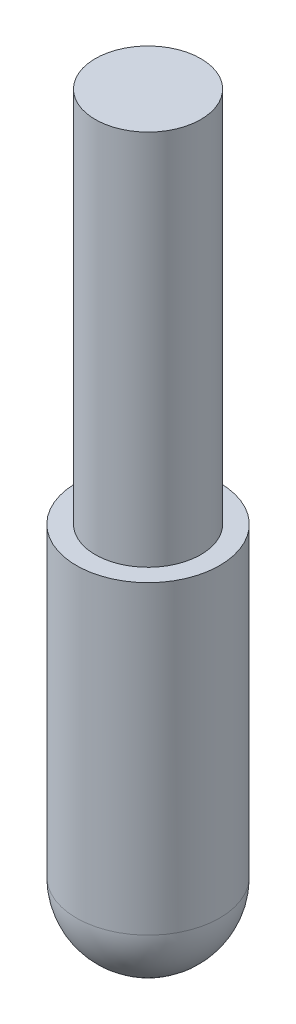
ISO-10303-21;
HEADER;
FILE_DESCRIPTION(('STEP AP214'),'2;1');
FILE_NAME('part.step','',(''),(''),'','','');
FILE_SCHEMA(('AUTOMOTIVE_DESIGN { 1 0 10303 214 1 1 1 1 }'));
ENDSEC;
DATA;
#1=APPLICATION_CONTEXT('core data for automotive mechanical design processes');
#2=APPLICATION_PROTOCOL_DEFINITION('international standard','automotive_design',2000,#1);
#3=PRODUCT_CONTEXT('',#1,'mechanical');
#4=PRODUCT('Part','Part','',(#3));
#5=PRODUCT_RELATED_PRODUCT_CATEGORY('part','',(#4));
#6=PRODUCT_DEFINITION_FORMATION('','',#4);
#7=PRODUCT_DEFINITION_CONTEXT('part definition',#1,'design');
#8=PRODUCT_DEFINITION('design','',#6,#7);
#9=PRODUCT_DEFINITION_SHAPE('','',#8);
#10=(LENGTH_UNIT() NAMED_UNIT(*) SI_UNIT(.MILLI.,.METRE.));
#11=(NAMED_UNIT(*) PLANE_ANGLE_UNIT() SI_UNIT($,.RADIAN.));
#12=(NAMED_UNIT(*) SI_UNIT($,.STERADIAN.) SOLID_ANGLE_UNIT());
#13=UNCERTAINTY_MEASURE_WITH_UNIT(LENGTH_MEASURE(1.E-05),#10,'distance_accuracy_value','');
#14=(GEOMETRIC_REPRESENTATION_CONTEXT(3) GLOBAL_UNCERTAINTY_ASSIGNED_CONTEXT((#13)) GLOBAL_UNIT_ASSIGNED_CONTEXT((#10,
#11,#12)) REPRESENTATION_CONTEXT('',''));
#15=CARTESIAN_POINT('',(0.,0.,0.));
#16=DIRECTION('',(0.,0.,1.));
#17=DIRECTION('',(1.,0.,0.));
#18=AXIS2_PLACEMENT_3D('',#15,#16,#17);
#19=CARTESIAN_POINT('',(0.,-20.25,0.));
#20=DIRECTION('',(0.,-1.,0.));
#21=DIRECTION('',(0.,0.,1.));
#22=AXIS2_PLACEMENT_3D('',#19,#20,#21);
#23=SPHERICAL_SURFACE('',#22,4.75000000000001);
#24=CARTESIAN_POINT('',(0.,-20.25,0.));
#25=DIRECTION('',(0.,-1.,0.));
#26=DIRECTION('',(0.,0.,-1.));
#27=AXIS2_PLACEMENT_3D('',#24,#25,#26);
#28=CIRCLE('',#27,4.75000000000001);
#29=CARTESIAN_POINT('',(0.,-20.25,-4.75000000000001));
#30=VERTEX_POINT('',#29);
#31=EDGE_CURVE('E10',#30,#30,#28,.T.);
#32=ORIENTED_EDGE('',*,*,#31,.T.);
#33=EDGE_LOOP('',(#32));
#34=FACE_BOUND('',#33,.T.);
#35=ADVANCED_FACE('F32',(#34),#23,.T.);
#36=CARTESIAN_POINT('',(0.,-25.,0.));
#37=DIRECTION('',(0.,-1.,0.));
#38=DIRECTION('',(0.,0.,-1.));
#39=AXIS2_PLACEMENT_3D('',#36,#37,#38);
#40=CYLINDRICAL_SURFACE('',#39,4.75000000000001);
#41=CARTESIAN_POINT('',(0.,0.,0.));
#42=DIRECTION('',(0.,-1.,0.));
#43=DIRECTION('',(0.,0.,-1.));
#44=AXIS2_PLACEMENT_3D('',#41,#42,#43);
#45=CIRCLE('',#44,4.75);
#46=CARTESIAN_POINT('',(0.,0.,-4.75000000000001));
#47=VERTEX_POINT('',#46);
#48=EDGE_CURVE('E38',#47,#47,#45,.T.);
#49=ORIENTED_EDGE('',*,*,#48,.T.);
#50=EDGE_LOOP('',(#49));
#51=FACE_BOUND('',#50,.T.);
#52=ORIENTED_EDGE('',*,*,#31,.F.);
#53=EDGE_LOOP('',(#52));
#54=FACE_BOUND('',#53,.T.);
#55=ADVANCED_FACE('F64',(#51,#54),#40,.T.);
#56=CARTESIAN_POINT('',(0.,0.,-3.5));
#57=DIRECTION('',(0.,1.,0.));
#58=DIRECTION('',(0.,0.,1.));
#59=AXIS2_PLACEMENT_3D('',#56,#57,#58);
#60=PLANE('',#59);
#61=CARTESIAN_POINT('',(0.,0.,0.));
#62=DIRECTION('',(0.,-1.,0.));
#63=DIRECTION('',(0.,0.,-1.));
#64=AXIS2_PLACEMENT_3D('',#61,#62,#63);
#65=CIRCLE('',#64,3.5);
#66=CARTESIAN_POINT('',(0.,0.,-3.5));
#67=VERTEX_POINT('',#66);
#68=EDGE_CURVE('E42',#67,#67,#65,.T.);
#69=ORIENTED_EDGE('',*,*,#68,.T.);
#70=EDGE_LOOP('',(#69));
#71=FACE_BOUND('',#70,.T.);
#72=ORIENTED_EDGE('',*,*,#48,.F.);
#73=EDGE_LOOP('',(#72));
#74=FACE_BOUND('',#73,.T.);
#75=ADVANCED_FACE('F61',(#71,#74),#60,.T.);
#76=CARTESIAN_POINT('',(0.,-25.,0.));
#77=DIRECTION('',(0.,-1.,0.));
#78=DIRECTION('',(0.,0.,-1.));
#79=AXIS2_PLACEMENT_3D('',#76,#77,#78);
#80=CYLINDRICAL_SURFACE('',#79,3.5);
#81=CARTESIAN_POINT('',(0.,25.,0.));
#82=DIRECTION('',(0.,-1.,0.));
#83=DIRECTION('',(0.,0.,-1.));
#84=AXIS2_PLACEMENT_3D('',#81,#82,#83);
#85=CIRCLE('',#84,3.5);
#86=CARTESIAN_POINT('',(0.,25.,-3.5));
#87=VERTEX_POINT('',#86);
#88=EDGE_CURVE('E46',#87,#87,#85,.T.);
#89=ORIENTED_EDGE('',*,*,#88,.T.);
#90=EDGE_LOOP('',(#89));
#91=FACE_BOUND('',#90,.T.);
#92=ORIENTED_EDGE('',*,*,#68,.F.);
#93=EDGE_LOOP('',(#92));
#94=FACE_BOUND('',#93,.T.);
#95=ADVANCED_FACE('F52',(#91,#94),#80,.T.);
#96=CARTESIAN_POINT('',(0.,25.,0.));
#97=DIRECTION('',(0.,1.,0.));
#98=DIRECTION('',(0.,0.,1.));
#99=AXIS2_PLACEMENT_3D('',#96,#97,#98);
#100=PLANE('',#99);
#101=ORIENTED_EDGE('',*,*,#88,.F.);
#102=EDGE_LOOP('',(#101));
#103=FACE_BOUND('',#102,.T.);
#104=ADVANCED_FACE('F55',(#103),#100,.T.);
#105=CLOSED_SHELL('',(#35,#55,#75,#95,#104));
#106=MANIFOLD_SOLID_BREP('B2',#105);
#107=ADVANCED_BREP_SHAPE_REPRESENTATION('',(#18,#106),#14);
#108=SHAPE_DEFINITION_REPRESENTATION(#9,#107);
ENDSEC;
END-ISO-10303-21;
